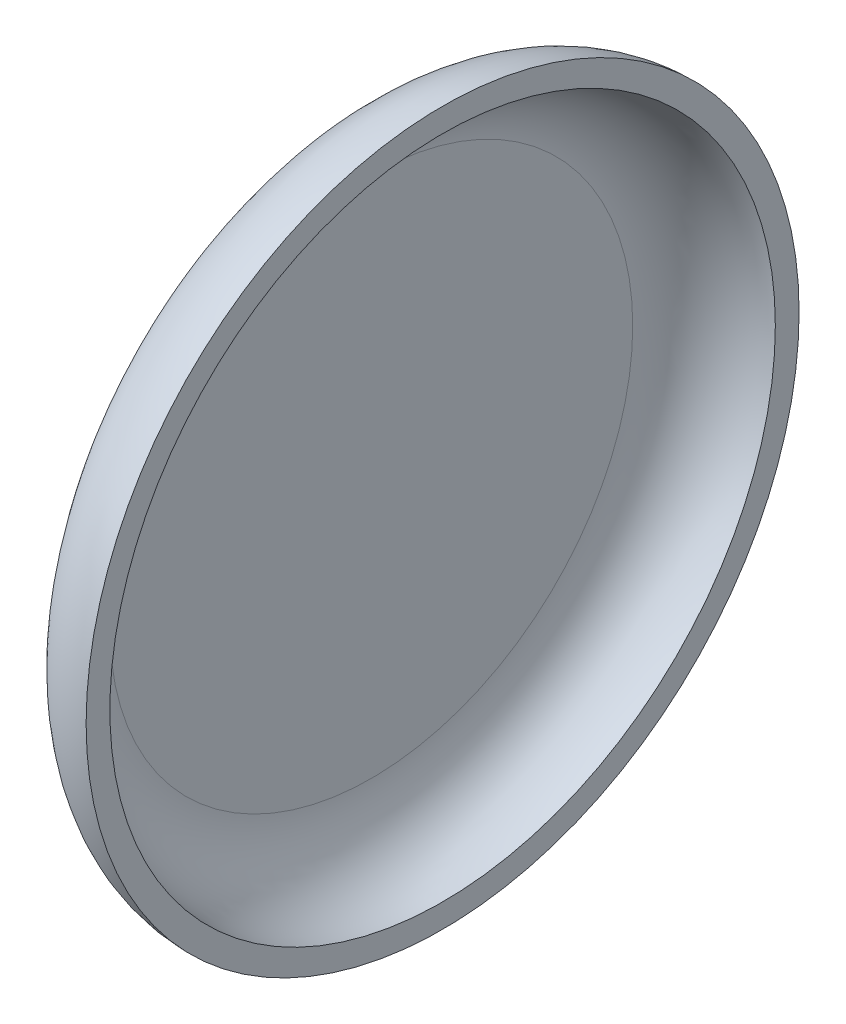
ISO-10303-21;
HEADER;
FILE_DESCRIPTION(('STEP AP214'),'2;1');
FILE_NAME('part.step','',(''),(''),'','','');
FILE_SCHEMA(('AUTOMOTIVE_DESIGN { 1 0 10303 214 1 1 1 1 }'));
ENDSEC;
DATA;
#1=APPLICATION_CONTEXT('core data for automotive mechanical design processes');
#2=APPLICATION_PROTOCOL_DEFINITION('international standard','automotive_design',2000,#1);
#3=PRODUCT_CONTEXT('',#1,'mechanical');
#4=PRODUCT('Part','Part','',(#3));
#5=PRODUCT_RELATED_PRODUCT_CATEGORY('part','',(#4));
#6=PRODUCT_DEFINITION_FORMATION('','',#4);
#7=PRODUCT_DEFINITION_CONTEXT('part definition',#1,'design');
#8=PRODUCT_DEFINITION('design','',#6,#7);
#9=PRODUCT_DEFINITION_SHAPE('','',#8);
#10=(LENGTH_UNIT() NAMED_UNIT(*) SI_UNIT(.MILLI.,.METRE.));
#11=(NAMED_UNIT(*) PLANE_ANGLE_UNIT() SI_UNIT($,.RADIAN.));
#12=(NAMED_UNIT(*) SI_UNIT($,.STERADIAN.) SOLID_ANGLE_UNIT());
#13=UNCERTAINTY_MEASURE_WITH_UNIT(LENGTH_MEASURE(1.E-05),#10,'distance_accuracy_value','');
#14=(GEOMETRIC_REPRESENTATION_CONTEXT(3) GLOBAL_UNCERTAINTY_ASSIGNED_CONTEXT((#13)) GLOBAL_UNIT_ASSIGNED_CONTEXT((#10,
#11,#12)) REPRESENTATION_CONTEXT('',''));
#15=CARTESIAN_POINT('',(0.,0.,0.));
#16=DIRECTION('',(0.,0.,1.));
#17=DIRECTION('',(1.,0.,0.));
#18=AXIS2_PLACEMENT_3D('',#15,#16,#17);
#19=CARTESIAN_POINT('',(-3.,0.,0.));
#20=DIRECTION('',(-1.,0.,0.));
#21=DIRECTION('',(0.,0.,1.));
#22=AXIS2_PLACEMENT_3D('',#19,#20,#21);
#23=PLANE('',#22);
#24=CARTESIAN_POINT('',(-3.,0.,0.));
#25=DIRECTION('',(1.,0.,0.));
#26=DIRECTION('',(0.,0.,-1.));
#27=AXIS2_PLACEMENT_3D('',#24,#25,#26);
#28=CIRCLE('',#27,11.);
#29=CARTESIAN_POINT('',(-3.,0.,-11.));
#30=VERTEX_POINT('',#29);
#31=EDGE_CURVE('E10',#30,#30,#28,.T.);
#32=ORIENTED_EDGE('',*,*,#31,.T.);
#33=EDGE_LOOP('',(#32));
#34=FACE_BOUND('',#33,.T.);
#35=ADVANCED_FACE('F34',(#34),#23,.F.);
#36=CARTESIAN_POINT('',(0.,0.,0.));
#37=DIRECTION('',(1.,0.,0.));
#38=DIRECTION('',(0.,0.,-1.));
#39=AXIS2_PLACEMENT_3D('',#36,#37,#38);
#40=TOROIDAL_SURFACE('',#39,11.,3.);
#41=CARTESIAN_POINT('',(0.,0.,0.));
#42=DIRECTION('',(1.,0.,0.));
#43=DIRECTION('',(0.,0.,-1.));
#44=AXIS2_PLACEMENT_3D('',#41,#42,#43);
#45=CIRCLE('',#44,14.);
#46=CARTESIAN_POINT('',(0.,0.,-14.));
#47=VERTEX_POINT('',#46);
#48=EDGE_CURVE('E40',#47,#47,#45,.T.);
#49=ORIENTED_EDGE('',*,*,#48,.T.);
#50=EDGE_LOOP('',(#49));
#51=FACE_BOUND('',#50,.T.);
#52=ORIENTED_EDGE('',*,*,#31,.F.);
#53=EDGE_LOOP('',(#52));
#54=FACE_BOUND('',#53,.T.);
#55=ADVANCED_FACE('F66',(#51,#54),#40,.F.);
#56=CARTESIAN_POINT('',(0.,0.,0.));
#57=DIRECTION('',(-1.,0.,0.));
#58=DIRECTION('',(0.,0.,1.));
#59=AXIS2_PLACEMENT_3D('',#56,#57,#58);
#60=PLANE('',#59);
#61=ORIENTED_EDGE('',*,*,#48,.F.);
#62=EDGE_LOOP('',(#61));
#63=FACE_BOUND('',#62,.T.);
#64=CARTESIAN_POINT('',(0.,0.,0.));
#65=DIRECTION('',(1.,0.,0.));
#66=DIRECTION('',(0.,0.,-1.));
#67=AXIS2_PLACEMENT_3D('',#64,#65,#66);
#68=CIRCLE('',#67,15.);
#69=CARTESIAN_POINT('',(0.,0.,-15.));
#70=VERTEX_POINT('',#69);
#71=EDGE_CURVE('E44',#70,#70,#68,.T.);
#72=ORIENTED_EDGE('',*,*,#71,.T.);
#73=EDGE_LOOP('',(#72));
#74=FACE_BOUND('',#73,.T.);
#75=ADVANCED_FACE('F62',(#63,#74),#60,.F.);
#76=CARTESIAN_POINT('',(0.,0.,0.));
#77=DIRECTION('',(1.,0.,0.));
#78=DIRECTION('',(0.,0.,-1.));
#79=AXIS2_PLACEMENT_3D('',#76,#77,#78);
#80=TOROIDAL_SURFACE('',#79,11.,4.);
#81=ORIENTED_EDGE('',*,*,#71,.F.);
#82=EDGE_LOOP('',(#81));
#83=FACE_BOUND('',#82,.T.);
#84=CARTESIAN_POINT('',(-4.,0.,0.));
#85=DIRECTION('',(1.,0.,0.));
#86=DIRECTION('',(0.,0.,-1.));
#87=AXIS2_PLACEMENT_3D('',#84,#85,#86);
#88=CIRCLE('',#87,11.);
#89=CARTESIAN_POINT('',(-4.,0.,-11.));
#90=VERTEX_POINT('',#89);
#91=EDGE_CURVE('E48',#90,#90,#88,.T.);
#92=ORIENTED_EDGE('',*,*,#91,.T.);
#93=EDGE_LOOP('',(#92));
#94=FACE_BOUND('',#93,.T.);
#95=ADVANCED_FACE('F54',(#83,#94),#80,.T.);
#96=CARTESIAN_POINT('',(-4.,0.,0.));
#97=DIRECTION('',(-1.,0.,0.));
#98=DIRECTION('',(0.,0.,1.));
#99=AXIS2_PLACEMENT_3D('',#96,#97,#98);
#100=PLANE('',#99);
#101=ORIENTED_EDGE('',*,*,#91,.F.);
#102=EDGE_LOOP('',(#101));
#103=FACE_BOUND('',#102,.T.);
#104=ADVANCED_FACE('F56',(#103),#100,.T.);
#105=CLOSED_SHELL('',(#35,#55,#75,#95,#104));
#106=MANIFOLD_SOLID_BREP('B2',#105);
#107=ADVANCED_BREP_SHAPE_REPRESENTATION('',(#18,#106),#14);
#108=SHAPE_DEFINITION_REPRESENTATION(#9,#107);
ENDSEC;
END-ISO-10303-21;
